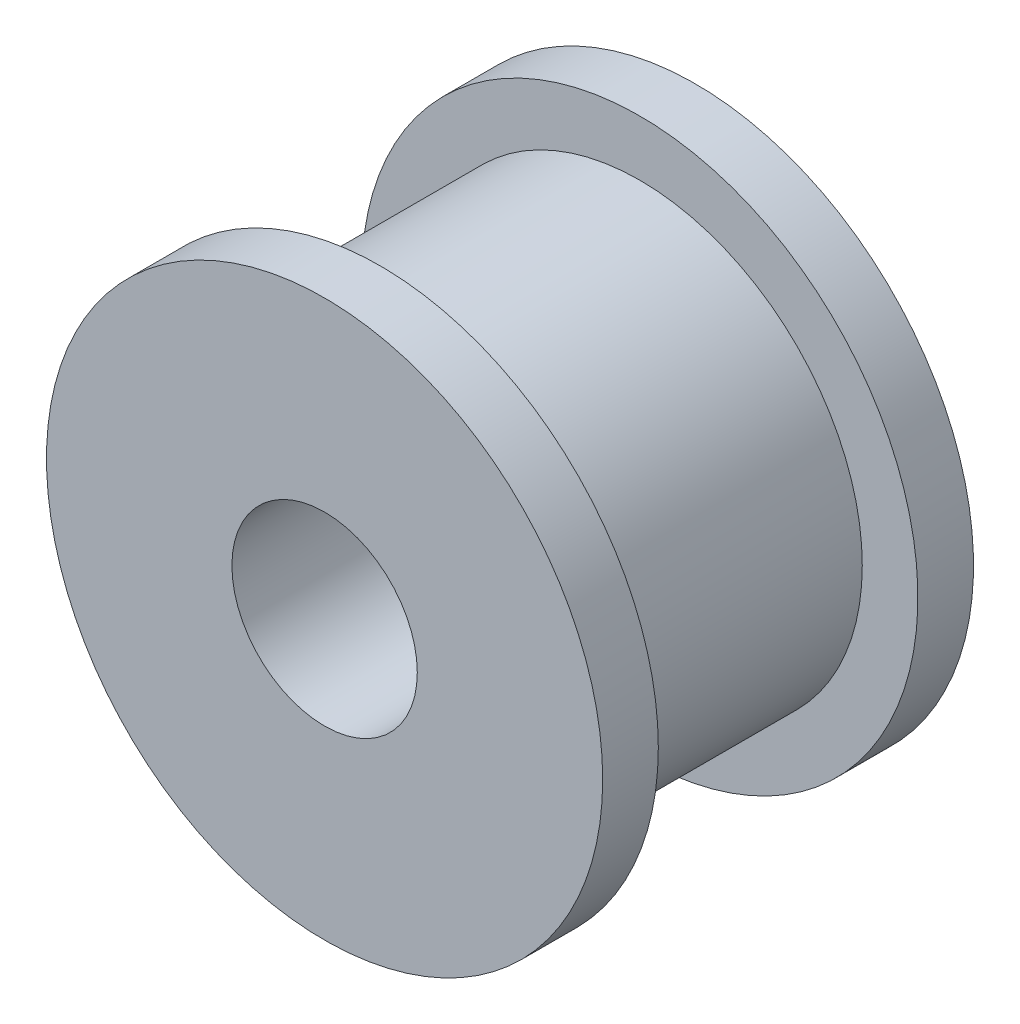
ISO-10303-21;
HEADER;
FILE_DESCRIPTION(('STEP AP214'),'2;1');
FILE_NAME('part.step','',(''),(''),'','','');
FILE_SCHEMA(('AUTOMOTIVE_DESIGN { 1 0 10303 214 1 1 1 1 }'));
ENDSEC;
DATA;
#1=APPLICATION_CONTEXT('core data for automotive mechanical design processes');
#2=APPLICATION_PROTOCOL_DEFINITION('international standard','automotive_design',2000,#1);
#3=PRODUCT_CONTEXT('',#1,'mechanical');
#4=PRODUCT('Part','Part','',(#3));
#5=PRODUCT_RELATED_PRODUCT_CATEGORY('part','',(#4));
#6=PRODUCT_DEFINITION_FORMATION('','',#4);
#7=PRODUCT_DEFINITION_CONTEXT('part definition',#1,'design');
#8=PRODUCT_DEFINITION('design','',#6,#7);
#9=PRODUCT_DEFINITION_SHAPE('','',#8);
#10=(LENGTH_UNIT() NAMED_UNIT(*) SI_UNIT(.MILLI.,.METRE.));
#11=(NAMED_UNIT(*) PLANE_ANGLE_UNIT() SI_UNIT($,.RADIAN.));
#12=(NAMED_UNIT(*) SI_UNIT($,.STERADIAN.) SOLID_ANGLE_UNIT());
#13=UNCERTAINTY_MEASURE_WITH_UNIT(LENGTH_MEASURE(1.E-05),#10,'distance_accuracy_value','');
#14=(GEOMETRIC_REPRESENTATION_CONTEXT(3) GLOBAL_UNCERTAINTY_ASSIGNED_CONTEXT((#13)) GLOBAL_UNIT_ASSIGNED_CONTEXT((#10,
#11,#12)) REPRESENTATION_CONTEXT('',''));
#15=CARTESIAN_POINT('',(0.,0.,0.));
#16=DIRECTION('',(0.,0.,1.));
#17=DIRECTION('',(1.,0.,0.));
#18=AXIS2_PLACEMENT_3D('',#15,#16,#17);
#19=CARTESIAN_POINT('',(0.,0.,0.));
#20=DIRECTION('',(0.,0.,1.));
#21=DIRECTION('',(1.,0.,0.));
#22=AXIS2_PLACEMENT_3D('',#19,#20,#21);
#23=CYLINDRICAL_SURFACE('',#22,2.5);
#24=CARTESIAN_POINT('',(0.,0.,10.));
#25=DIRECTION('',(0.,0.,1.));
#26=DIRECTION('',(1.,0.,0.));
#27=AXIS2_PLACEMENT_3D('',#24,#25,#26);
#28=CIRCLE('',#27,2.5);
#29=CARTESIAN_POINT('',(2.5,0.,10.));
#30=VERTEX_POINT('',#29);
#31=EDGE_CURVE('E19',#30,#30,#28,.F.);
#32=ORIENTED_EDGE('',*,*,#31,.F.);
#33=EDGE_LOOP('',(#32));
#34=FACE_BOUND('',#33,.T.);
#35=CARTESIAN_POINT('',(0.,0.,0.));
#36=DIRECTION('',(0.,0.,1.));
#37=DIRECTION('',(1.,0.,0.));
#38=AXIS2_PLACEMENT_3D('',#35,#36,#37);
#39=CIRCLE('',#38,2.5);
#40=CARTESIAN_POINT('',(2.5,0.,0.));
#41=VERTEX_POINT('',#40);
#42=EDGE_CURVE('E41',#41,#41,#39,.T.);
#43=ORIENTED_EDGE('',*,*,#42,.F.);
#44=EDGE_LOOP('',(#43));
#45=FACE_BOUND('',#44,.T.);
#46=ADVANCED_FACE('F15',(#34,#45),#23,.F.);
#47=CARTESIAN_POINT('',(-7.51,-7.51,10.));
#48=DIRECTION('',(0.,0.,1.));
#49=DIRECTION('',(1.,0.,0.));
#50=AXIS2_PLACEMENT_3D('',#47,#48,#49);
#51=PLANE('',#50);
#52=ORIENTED_EDGE('',*,*,#31,.T.);
#53=EDGE_LOOP('',(#52));
#54=FACE_BOUND('',#53,.T.);
#55=CARTESIAN_POINT('',(0.,0.,10.));
#56=DIRECTION('',(0.,0.,1.));
#57=DIRECTION('',(1.,0.,0.));
#58=AXIS2_PLACEMENT_3D('',#55,#56,#57);
#59=CIRCLE('',#58,7.5);
#60=CARTESIAN_POINT('',(7.5,0.,10.));
#61=VERTEX_POINT('',#60);
#62=EDGE_CURVE('E39',#61,#61,#59,.F.);
#63=ORIENTED_EDGE('',*,*,#62,.F.);
#64=EDGE_LOOP('',(#63));
#65=FACE_BOUND('',#64,.T.);
#66=ADVANCED_FACE('F48',(#54,#65),#51,.T.);
#67=CARTESIAN_POINT('',(7.51,-7.51,0.));
#68=DIRECTION('',(0.,0.,-1.));
#69=DIRECTION('',(-1.,0.,0.));
#70=AXIS2_PLACEMENT_3D('',#67,#68,#69);
#71=PLANE('',#70);
#72=ORIENTED_EDGE('',*,*,#42,.T.);
#73=EDGE_LOOP('',(#72));
#74=FACE_BOUND('',#73,.T.);
#75=CARTESIAN_POINT('',(0.,0.,0.));
#76=DIRECTION('',(0.,0.,-1.));
#77=DIRECTION('',(-1.,0.,0.));
#78=AXIS2_PLACEMENT_3D('',#75,#76,#77);
#79=CIRCLE('',#78,7.5);
#80=CARTESIAN_POINT('',(-7.5,0.,0.));
#81=VERTEX_POINT('',#80);
#82=EDGE_CURVE('E36',#81,#81,#79,.F.);
#83=ORIENTED_EDGE('',*,*,#82,.F.);
#84=EDGE_LOOP('',(#83));
#85=FACE_BOUND('',#84,.T.);
#86=ADVANCED_FACE('F58',(#74,#85),#71,.T.);
#87=CARTESIAN_POINT('',(0.,0.,8.5));
#88=DIRECTION('',(0.,0.,1.));
#89=DIRECTION('',(1.,0.,0.));
#90=AXIS2_PLACEMENT_3D('',#87,#88,#89);
#91=CYLINDRICAL_SURFACE('',#90,7.5);
#92=ORIENTED_EDGE('',*,*,#62,.T.);
#93=EDGE_LOOP('',(#92));
#94=FACE_BOUND('',#93,.T.);
#95=CARTESIAN_POINT('',(0.,0.,8.5));
#96=DIRECTION('',(0.,0.,1.));
#97=DIRECTION('',(1.,0.,0.));
#98=AXIS2_PLACEMENT_3D('',#95,#96,#97);
#99=CIRCLE('',#98,7.5);
#100=CARTESIAN_POINT('',(7.5,0.,8.5));
#101=VERTEX_POINT('',#100);
#102=EDGE_CURVE('E33',#101,#101,#99,.F.);
#103=ORIENTED_EDGE('',*,*,#102,.F.);
#104=EDGE_LOOP('',(#103));
#105=FACE_BOUND('',#104,.T.);
#106=ADVANCED_FACE('F76',(#94,#105),#91,.T.);
#107=CARTESIAN_POINT('',(0.,0.,1.5));
#108=DIRECTION('',(0.,0.,-1.));
#109=DIRECTION('',(-1.,0.,0.));
#110=AXIS2_PLACEMENT_3D('',#107,#108,#109);
#111=CYLINDRICAL_SURFACE('',#110,7.5);
#112=ORIENTED_EDGE('',*,*,#82,.T.);
#113=EDGE_LOOP('',(#112));
#114=FACE_BOUND('',#113,.T.);
#115=CARTESIAN_POINT('',(0.,0.,1.5));
#116=DIRECTION('',(0.,0.,-1.));
#117=DIRECTION('',(-1.,0.,0.));
#118=AXIS2_PLACEMENT_3D('',#115,#116,#117);
#119=CIRCLE('',#118,7.5);
#120=CARTESIAN_POINT('',(-7.5,0.,1.5));
#121=VERTEX_POINT('',#120);
#122=EDGE_CURVE('E28',#121,#121,#119,.F.);
#123=ORIENTED_EDGE('',*,*,#122,.F.);
#124=EDGE_LOOP('',(#123));
#125=FACE_BOUND('',#124,.T.);
#126=ADVANCED_FACE('F72',(#114,#125),#111,.T.);
#127=CARTESIAN_POINT('',(7.51,-7.51,8.5));
#128=DIRECTION('',(0.,0.,-1.));
#129=DIRECTION('',(-1.,0.,0.));
#130=AXIS2_PLACEMENT_3D('',#127,#128,#129);
#131=PLANE('',#130);
#132=CARTESIAN_POINT('',(0.,0.,8.5));
#133=DIRECTION('',(0.,0.,-1.));
#134=DIRECTION('',(-1.,0.,0.));
#135=AXIS2_PLACEMENT_3D('',#132,#133,#134);
#136=CIRCLE('',#135,6.);
#137=CARTESIAN_POINT('',(-6.,0.,8.5));
#138=VERTEX_POINT('',#137);
#139=EDGE_CURVE('E23',#138,#138,#136,.T.);
#140=ORIENTED_EDGE('',*,*,#139,.F.);
#141=EDGE_LOOP('',(#140));
#142=FACE_BOUND('',#141,.T.);
#143=ORIENTED_EDGE('',*,*,#102,.T.);
#144=EDGE_LOOP('',(#143));
#145=FACE_BOUND('',#144,.T.);
#146=ADVANCED_FACE('F65',(#142,#145),#131,.T.);
#147=CARTESIAN_POINT('',(-7.51,-7.51,1.5));
#148=DIRECTION('',(0.,0.,1.));
#149=DIRECTION('',(1.,0.,0.));
#150=AXIS2_PLACEMENT_3D('',#147,#148,#149);
#151=PLANE('',#150);
#152=CARTESIAN_POINT('',(0.,0.,1.5));
#153=DIRECTION('',(0.,0.,-1.));
#154=DIRECTION('',(-1.,0.,0.));
#155=AXIS2_PLACEMENT_3D('',#152,#153,#154);
#156=CIRCLE('',#155,6.);
#157=CARTESIAN_POINT('',(-6.,0.,1.5));
#158=VERTEX_POINT('',#157);
#159=EDGE_CURVE('E10',#158,#158,#156,.F.);
#160=ORIENTED_EDGE('',*,*,#159,.F.);
#161=EDGE_LOOP('',(#160));
#162=FACE_BOUND('',#161,.T.);
#163=ORIENTED_EDGE('',*,*,#122,.T.);
#164=EDGE_LOOP('',(#163));
#165=FACE_BOUND('',#164,.T.);
#166=ADVANCED_FACE('F61',(#162,#165),#151,.T.);
#167=CARTESIAN_POINT('',(0.,0.,8.5));
#168=DIRECTION('',(0.,0.,-1.));
#169=DIRECTION('',(-1.,0.,0.));
#170=AXIS2_PLACEMENT_3D('',#167,#168,#169);
#171=CYLINDRICAL_SURFACE('',#170,6.);
#172=ORIENTED_EDGE('',*,*,#159,.T.);
#173=EDGE_LOOP('',(#172));
#174=FACE_BOUND('',#173,.T.);
#175=ORIENTED_EDGE('',*,*,#139,.T.);
#176=EDGE_LOOP('',(#175));
#177=FACE_BOUND('',#176,.T.);
#178=ADVANCED_FACE('F17',(#174,#177),#171,.T.);
#179=CLOSED_SHELL('',(#46,#66,#86,#106,#126,#146,#166,#178));
#180=MANIFOLD_SOLID_BREP('B1',#179);
#181=ADVANCED_BREP_SHAPE_REPRESENTATION('',(#18,#180),#14);
#182=SHAPE_DEFINITION_REPRESENTATION(#9,#181);
ENDSEC;
END-ISO-10303-21;
